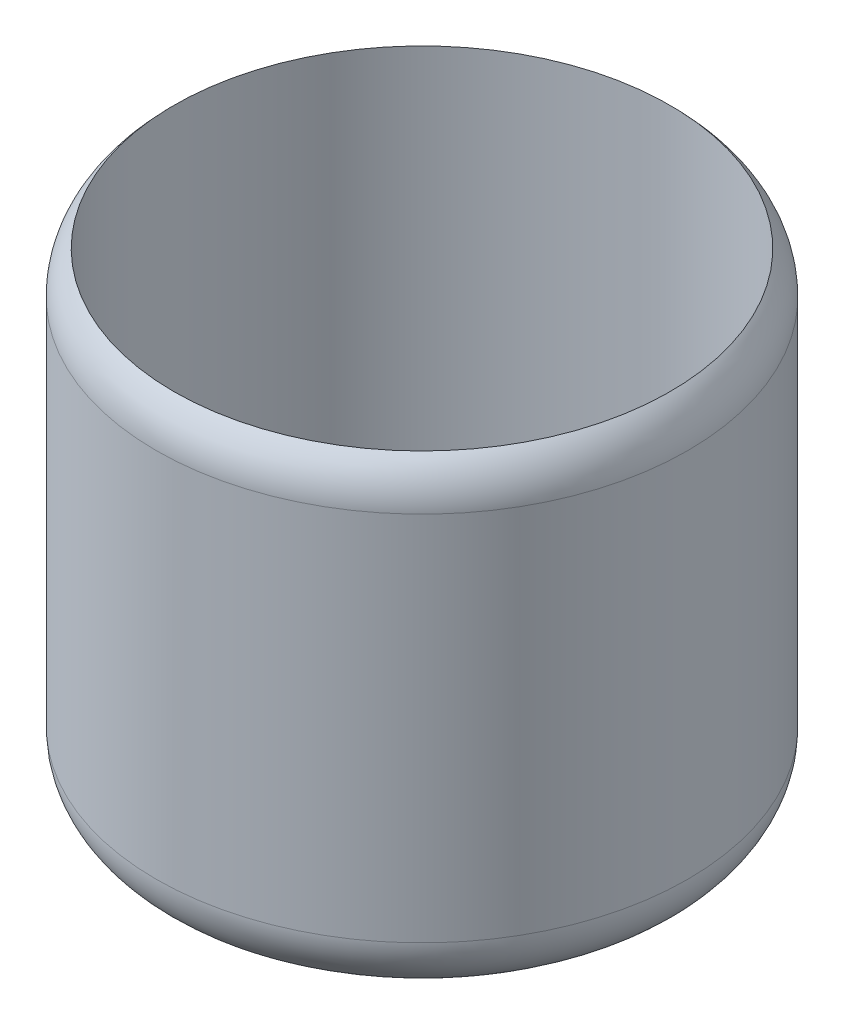
ISO-10303-21;
HEADER;
FILE_DESCRIPTION(('STEP AP214'),'2;1');
FILE_NAME('part.step','',(''),(''),'','','');
FILE_SCHEMA(('AUTOMOTIVE_DESIGN { 1 0 10303 214 1 1 1 1 }'));
ENDSEC;
DATA;
#1=APPLICATION_CONTEXT('core data for automotive mechanical design processes');
#2=APPLICATION_PROTOCOL_DEFINITION('international standard','automotive_design',2000,#1);
#3=PRODUCT_CONTEXT('',#1,'mechanical');
#4=PRODUCT('Part','Part','',(#3));
#5=PRODUCT_RELATED_PRODUCT_CATEGORY('part','',(#4));
#6=PRODUCT_DEFINITION_FORMATION('','',#4);
#7=PRODUCT_DEFINITION_CONTEXT('part definition',#1,'design');
#8=PRODUCT_DEFINITION('design','',#6,#7);
#9=PRODUCT_DEFINITION_SHAPE('','',#8);
#10=(LENGTH_UNIT() NAMED_UNIT(*) SI_UNIT(.MILLI.,.METRE.));
#11=(NAMED_UNIT(*) PLANE_ANGLE_UNIT() SI_UNIT($,.RADIAN.));
#12=(NAMED_UNIT(*) SI_UNIT($,.STERADIAN.) SOLID_ANGLE_UNIT());
#13=UNCERTAINTY_MEASURE_WITH_UNIT(LENGTH_MEASURE(1.E-05),#10,'distance_accuracy_value','');
#14=(GEOMETRIC_REPRESENTATION_CONTEXT(3) GLOBAL_UNCERTAINTY_ASSIGNED_CONTEXT((#13)) GLOBAL_UNIT_ASSIGNED_CONTEXT((#10,
#11,#12)) REPRESENTATION_CONTEXT('',''));
#15=CARTESIAN_POINT('',(0.,0.,0.));
#16=DIRECTION('',(0.,0.,1.));
#17=DIRECTION('',(1.,0.,0.));
#18=AXIS2_PLACEMENT_3D('',#15,#16,#17);
#19=CARTESIAN_POINT('',(0.,40.,0.));
#20=DIRECTION('',(0.,-1.,0.));
#21=DIRECTION('',(0.,0.,-1.));
#22=AXIS2_PLACEMENT_3D('',#19,#20,#21);
#23=CYLINDRICAL_SURFACE('',#22,22.5);
#24=CARTESIAN_POINT('',(0.,36.4292857857286,0.));
#25=DIRECTION('',(0.,1.,0.));
#26=DIRECTION('',(0.,0.,1.));
#27=AXIS2_PLACEMENT_3D('',#24,#25,#26);
#28=CIRCLE('',#27,22.5);
#29=CARTESIAN_POINT('',(0.,36.4292857857286,22.5));
#30=VERTEX_POINT('',#29);
#31=EDGE_CURVE('E38',#30,#30,#28,.F.);
#32=ORIENTED_EDGE('',*,*,#31,.T.);
#33=EDGE_LOOP('',(#32));
#34=FACE_BOUND('',#33,.T.);
#35=CARTESIAN_POINT('',(0.,5.,0.));
#36=DIRECTION('',(0.,1.,0.));
#37=DIRECTION('',(0.,0.,1.));
#38=AXIS2_PLACEMENT_3D('',#35,#36,#37);
#39=CIRCLE('',#38,22.5);
#40=CARTESIAN_POINT('',(0.,5.,22.5));
#41=VERTEX_POINT('',#40);
#42=EDGE_CURVE('E42',#41,#41,#39,.T.);
#43=ORIENTED_EDGE('',*,*,#42,.T.);
#44=EDGE_LOOP('',(#43));
#45=FACE_BOUND('',#44,.T.);
#46=ADVANCED_FACE('F31',(#34,#45),#23,.T.);
#47=CARTESIAN_POINT('',(0.,0.,0.));
#48=DIRECTION('',(0.,1.,0.));
#49=DIRECTION('',(0.,0.,1.));
#50=AXIS2_PLACEMENT_3D('',#47,#48,#49);
#51=PLANE('',#50);
#52=CARTESIAN_POINT('',(0.,0.,0.));
#53=DIRECTION('',(0.,1.,0.));
#54=DIRECTION('',(0.,0.,1.));
#55=AXIS2_PLACEMENT_3D('',#52,#53,#54);
#56=CIRCLE('',#55,17.5);
#57=CARTESIAN_POINT('',(0.,0.,17.5));
#58=VERTEX_POINT('',#57);
#59=EDGE_CURVE('E10',#58,#58,#56,.F.);
#60=ORIENTED_EDGE('',*,*,#59,.T.);
#61=EDGE_LOOP('',(#60));
#62=FACE_BOUND('',#61,.T.);
#63=ADVANCED_FACE('F60',(#62),#51,.F.);
#64=CARTESIAN_POINT('',(0.,3.,0.));
#65=DIRECTION('',(0.,1.,0.));
#66=DIRECTION('',(0.,0.,1.));
#67=AXIS2_PLACEMENT_3D('',#64,#65,#66);
#68=CYLINDRICAL_SURFACE('',#67,21.);
#69=CARTESIAN_POINT('',(0.,3.,0.));
#70=DIRECTION('',(0.,1.,0.));
#71=DIRECTION('',(0.,0.,1.));
#72=AXIS2_PLACEMENT_3D('',#69,#70,#71);
#73=CIRCLE('',#72,21.);
#74=CARTESIAN_POINT('',(0.,3.,21.));
#75=VERTEX_POINT('',#74);
#76=EDGE_CURVE('E46',#75,#75,#73,.T.);
#77=ORIENTED_EDGE('',*,*,#76,.F.);
#78=EDGE_LOOP('',(#77));
#79=FACE_BOUND('',#78,.T.);
#80=CARTESIAN_POINT('',(0.,40.,0.));
#81=DIRECTION('',(0.,1.,0.));
#82=DIRECTION('',(0.,0.,1.));
#83=AXIS2_PLACEMENT_3D('',#80,#81,#82);
#84=CIRCLE('',#83,21.);
#85=CARTESIAN_POINT('',(0.,40.,21.));
#86=VERTEX_POINT('',#85);
#87=EDGE_CURVE('E49',#86,#86,#84,.T.);
#88=ORIENTED_EDGE('',*,*,#87,.T.);
#89=EDGE_LOOP('',(#88));
#90=FACE_BOUND('',#89,.T.);
#91=ADVANCED_FACE('F57',(#79,#90),#68,.F.);
#92=CARTESIAN_POINT('',(0.,3.,0.));
#93=DIRECTION('',(0.,1.,0.));
#94=DIRECTION('',(0.,0.,1.));
#95=AXIS2_PLACEMENT_3D('',#92,#93,#94);
#96=PLANE('',#95);
#97=ORIENTED_EDGE('',*,*,#76,.T.);
#98=EDGE_LOOP('',(#97));
#99=FACE_BOUND('',#98,.T.);
#100=ADVANCED_FACE('F55',(#99),#96,.T.);
#101=CARTESIAN_POINT('',(0.,36.4292857857286,0.));
#102=DIRECTION('',(0.,1.,0.));
#103=DIRECTION('',(0.,0.,1.));
#104=AXIS2_PLACEMENT_3D('',#101,#102,#103);
#105=TOROIDAL_SURFACE('',#104,17.5,5.);
#106=ORIENTED_EDGE('',*,*,#31,.F.);
#107=EDGE_LOOP('',(#106));
#108=FACE_BOUND('',#107,.T.);
#109=ORIENTED_EDGE('',*,*,#87,.F.);
#110=EDGE_LOOP('',(#109));
#111=FACE_BOUND('',#110,.T.);
#112=ADVANCED_FACE('F64',(#108,#111),#105,.T.);
#113=CARTESIAN_POINT('',(0.,5.,0.));
#114=DIRECTION('',(0.,1.,0.));
#115=DIRECTION('',(0.,0.,1.));
#116=AXIS2_PLACEMENT_3D('',#113,#114,#115);
#117=TOROIDAL_SURFACE('',#116,17.5,5.);
#118=ORIENTED_EDGE('',*,*,#59,.F.);
#119=EDGE_LOOP('',(#118));
#120=FACE_BOUND('',#119,.T.);
#121=ORIENTED_EDGE('',*,*,#42,.F.);
#122=EDGE_LOOP('',(#121));
#123=FACE_BOUND('',#122,.T.);
#124=ADVANCED_FACE('F33',(#120,#123),#117,.T.);
#125=CLOSED_SHELL('',(#46,#63,#91,#100,#112,#124));
#126=MANIFOLD_SOLID_BREP('B2',#125);
#127=ADVANCED_BREP_SHAPE_REPRESENTATION('',(#18,#126),#14);
#128=SHAPE_DEFINITION_REPRESENTATION(#9,#127);
ENDSEC;
END-ISO-10303-21;
